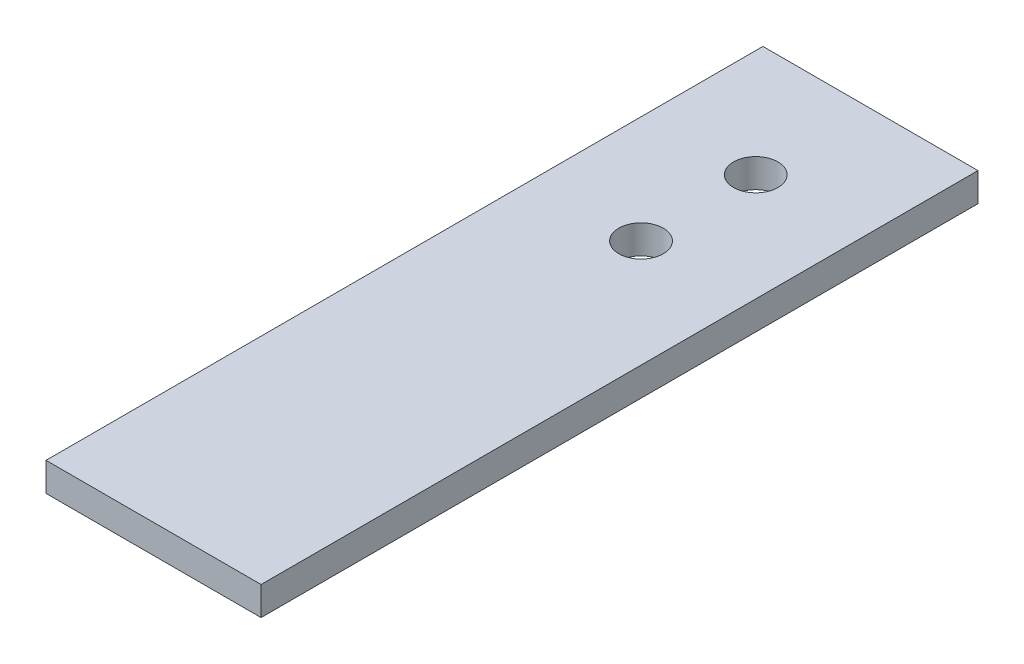
ISO-10303-21;
HEADER;
FILE_DESCRIPTION(('STEP AP214'),'2;1');
FILE_NAME('part.step','',(''),(''),'','','');
FILE_SCHEMA(('AUTOMOTIVE_DESIGN { 1 0 10303 214 1 1 1 1 }'));
ENDSEC;
DATA;
#1=APPLICATION_CONTEXT('core data for automotive mechanical design processes');
#2=APPLICATION_PROTOCOL_DEFINITION('international standard','automotive_design',2000,#1);
#3=PRODUCT_CONTEXT('',#1,'mechanical');
#4=PRODUCT('Part','Part','',(#3));
#5=PRODUCT_RELATED_PRODUCT_CATEGORY('part','',(#4));
#6=PRODUCT_DEFINITION_FORMATION('','',#4);
#7=PRODUCT_DEFINITION_CONTEXT('part definition',#1,'design');
#8=PRODUCT_DEFINITION('design','',#6,#7);
#9=PRODUCT_DEFINITION_SHAPE('','',#8);
#10=(LENGTH_UNIT() NAMED_UNIT(*) SI_UNIT(.MILLI.,.METRE.));
#11=(NAMED_UNIT(*) PLANE_ANGLE_UNIT() SI_UNIT($,.RADIAN.));
#12=(NAMED_UNIT(*) SI_UNIT($,.STERADIAN.) SOLID_ANGLE_UNIT());
#13=UNCERTAINTY_MEASURE_WITH_UNIT(LENGTH_MEASURE(1.E-05),#10,'distance_accuracy_value','');
#14=(GEOMETRIC_REPRESENTATION_CONTEXT(3) GLOBAL_UNCERTAINTY_ASSIGNED_CONTEXT((#13)) GLOBAL_UNIT_ASSIGNED_CONTEXT((#10,
#11,#12)) REPRESENTATION_CONTEXT('',''));
#15=CARTESIAN_POINT('',(0.,0.,0.));
#16=DIRECTION('',(0.,0.,1.));
#17=DIRECTION('',(1.,0.,0.));
#18=AXIS2_PLACEMENT_3D('',#15,#16,#17);
#19=CARTESIAN_POINT('',(0.,2.,0.));
#20=DIRECTION('',(0.,0.,1.));
#21=DIRECTION('',(1.,0.,0.));
#22=AXIS2_PLACEMENT_3D('',#19,#20,#21);
#23=PLANE('',#22);
#24=DIRECTION('',(-1.,0.,0.));
#25=VECTOR('',#24,1.);
#26=CARTESIAN_POINT('',(0.,0.,0.));
#27=LINE('',#26,#25);
#28=CARTESIAN_POINT('',(15.,0.,0.));
#29=VERTEX_POINT('',#28);
#30=CARTESIAN_POINT('',(0.,0.,0.));
#31=VERTEX_POINT('',#30);
#32=EDGE_CURVE('E105',#29,#31,#27,.T.);
#33=ORIENTED_EDGE('',*,*,#32,.F.);
#34=DIRECTION('',(0.,-1.,0.));
#35=VECTOR('',#34,1.);
#36=CARTESIAN_POINT('',(15.,2.,0.));
#37=LINE('',#36,#35);
#38=CARTESIAN_POINT('',(15.,2.,0.));
#39=VERTEX_POINT('',#38);
#40=EDGE_CURVE('E11',#39,#29,#37,.T.);
#41=ORIENTED_EDGE('',*,*,#40,.F.);
#42=DIRECTION('',(-1.,0.,0.));
#43=VECTOR('',#42,1.);
#44=CARTESIAN_POINT('',(0.,2.,0.));
#45=LINE('',#44,#43);
#46=CARTESIAN_POINT('',(0.,2.,0.));
#47=VERTEX_POINT('',#46);
#48=EDGE_CURVE('E91',#39,#47,#45,.T.);
#49=ORIENTED_EDGE('',*,*,#48,.T.);
#50=DIRECTION('',(0.,-1.,0.));
#51=VECTOR('',#50,1.);
#52=CARTESIAN_POINT('',(0.,2.,0.));
#53=LINE('',#52,#51);
#54=EDGE_CURVE('E52',#47,#31,#53,.T.);
#55=ORIENTED_EDGE('',*,*,#54,.T.);
#56=EDGE_LOOP('',(#33,#41,#49,#55));
#57=FACE_BOUND('',#56,.T.);
#58=ADVANCED_FACE('F35',(#57),#23,.T.);
#59=CARTESIAN_POINT('',(15.,2.,0.));
#60=DIRECTION('',(1.,0.,0.));
#61=DIRECTION('',(0.,0.,-1.));
#62=AXIS2_PLACEMENT_3D('',#59,#60,#61);
#63=PLANE('',#62);
#64=DIRECTION('',(0.,0.,1.));
#65=VECTOR('',#64,1.);
#66=CARTESIAN_POINT('',(15.,0.,0.));
#67=LINE('',#66,#65);
#68=CARTESIAN_POINT('',(15.,0.,-50.));
#69=VERTEX_POINT('',#68);
#70=EDGE_CURVE('E82',#69,#29,#67,.T.);
#71=ORIENTED_EDGE('',*,*,#70,.F.);
#72=DIRECTION('',(0.,-1.,0.));
#73=VECTOR('',#72,1.);
#74=CARTESIAN_POINT('',(15.,2.,-50.));
#75=LINE('',#74,#73);
#76=CARTESIAN_POINT('',(15.,2.,-50.));
#77=VERTEX_POINT('',#76);
#78=EDGE_CURVE('E44',#77,#69,#75,.T.);
#79=ORIENTED_EDGE('',*,*,#78,.F.);
#80=DIRECTION('',(0.,0.,1.));
#81=VECTOR('',#80,1.);
#82=CARTESIAN_POINT('',(15.,2.,0.));
#83=LINE('',#82,#81);
#84=EDGE_CURVE('E80',#77,#39,#83,.T.);
#85=ORIENTED_EDGE('',*,*,#84,.T.);
#86=ORIENTED_EDGE('',*,*,#40,.T.);
#87=EDGE_LOOP('',(#71,#79,#85,#86));
#88=FACE_BOUND('',#87,.T.);
#89=ADVANCED_FACE('F79',(#88),#63,.T.);
#90=CARTESIAN_POINT('',(0.,2.,-50.));
#91=DIRECTION('',(0.,0.,-1.));
#92=DIRECTION('',(-1.,0.,0.));
#93=AXIS2_PLACEMENT_3D('',#90,#91,#92);
#94=PLANE('',#93);
#95=DIRECTION('',(1.,0.,0.));
#96=VECTOR('',#95,1.);
#97=CARTESIAN_POINT('',(0.,0.,-50.));
#98=LINE('',#97,#96);
#99=CARTESIAN_POINT('',(0.,0.,-50.));
#100=VERTEX_POINT('',#99);
#101=EDGE_CURVE('E108',#100,#69,#98,.T.);
#102=ORIENTED_EDGE('',*,*,#101,.F.);
#103=DIRECTION('',(0.,-1.,0.));
#104=VECTOR('',#103,1.);
#105=CARTESIAN_POINT('',(0.,2.,-50.));
#106=LINE('',#105,#104);
#107=CARTESIAN_POINT('',(0.,2.,-50.));
#108=VERTEX_POINT('',#107);
#109=EDGE_CURVE('E65',#108,#100,#106,.T.);
#110=ORIENTED_EDGE('',*,*,#109,.F.);
#111=DIRECTION('',(1.,0.,0.));
#112=VECTOR('',#111,1.);
#113=CARTESIAN_POINT('',(0.,2.,-50.));
#114=LINE('',#113,#112);
#115=EDGE_CURVE('E90',#108,#77,#114,.T.);
#116=ORIENTED_EDGE('',*,*,#115,.T.);
#117=ORIENTED_EDGE('',*,*,#78,.T.);
#118=EDGE_LOOP('',(#102,#110,#116,#117));
#119=FACE_BOUND('',#118,.T.);
#120=ADVANCED_FACE('F93',(#119),#94,.T.);
#121=CARTESIAN_POINT('',(7.5,2.,-42.));
#122=DIRECTION('',(0.,-1.,0.));
#123=DIRECTION('',(0.,0.,-1.));
#124=AXIS2_PLACEMENT_3D('',#121,#122,#123);
#125=CYLINDRICAL_SURFACE('',#124,1.55);
#126=CARTESIAN_POINT('',(7.5,2.,-42.));
#127=DIRECTION('',(0.,1.,0.));
#128=DIRECTION('',(0.,0.,1.));
#129=AXIS2_PLACEMENT_3D('',#126,#127,#128);
#130=CIRCLE('',#129,1.55);
#131=CARTESIAN_POINT('',(7.5,2.,-40.45));
#132=VERTEX_POINT('',#131);
#133=EDGE_CURVE('E117',#132,#132,#130,.T.);
#134=ORIENTED_EDGE('',*,*,#133,.T.);
#135=EDGE_LOOP('',(#134));
#136=FACE_BOUND('',#135,.T.);
#137=CARTESIAN_POINT('',(7.5,0.,-42.));
#138=DIRECTION('',(0.,1.,0.));
#139=DIRECTION('',(0.,0.,1.));
#140=AXIS2_PLACEMENT_3D('',#137,#138,#139);
#141=CIRCLE('',#140,1.55);
#142=CARTESIAN_POINT('',(7.5,0.,-40.45));
#143=VERTEX_POINT('',#142);
#144=EDGE_CURVE('E102',#143,#143,#141,.T.);
#145=ORIENTED_EDGE('',*,*,#144,.F.);
#146=EDGE_LOOP('',(#145));
#147=FACE_BOUND('',#146,.T.);
#148=ADVANCED_FACE('F133',(#136,#147),#125,.F.);
#149=CARTESIAN_POINT('',(7.5,2.,-34.));
#150=DIRECTION('',(0.,-1.,0.));
#151=DIRECTION('',(0.,0.,-1.));
#152=AXIS2_PLACEMENT_3D('',#149,#150,#151);
#153=CYLINDRICAL_SURFACE('',#152,1.55);
#154=CARTESIAN_POINT('',(7.5,2.,-34.));
#155=DIRECTION('',(0.,1.,0.));
#156=DIRECTION('',(0.,0.,1.));
#157=AXIS2_PLACEMENT_3D('',#154,#155,#156);
#158=CIRCLE('',#157,1.55);
#159=CARTESIAN_POINT('',(7.5,2.,-32.45));
#160=VERTEX_POINT('',#159);
#161=EDGE_CURVE('E113',#160,#160,#158,.T.);
#162=ORIENTED_EDGE('',*,*,#161,.T.);
#163=EDGE_LOOP('',(#162));
#164=FACE_BOUND('',#163,.T.);
#165=CARTESIAN_POINT('',(7.5,0.,-34.));
#166=DIRECTION('',(0.,1.,0.));
#167=DIRECTION('',(0.,0.,1.));
#168=AXIS2_PLACEMENT_3D('',#165,#166,#167);
#169=CIRCLE('',#168,1.55);
#170=CARTESIAN_POINT('',(7.5,0.,-32.45));
#171=VERTEX_POINT('',#170);
#172=EDGE_CURVE('E99',#171,#171,#169,.T.);
#173=ORIENTED_EDGE('',*,*,#172,.F.);
#174=EDGE_LOOP('',(#173));
#175=FACE_BOUND('',#174,.T.);
#176=ADVANCED_FACE('F37',(#164,#175),#153,.F.);
#177=CARTESIAN_POINT('',(0.,2.,0.));
#178=DIRECTION('',(-1.,0.,0.));
#179=DIRECTION('',(0.,0.,1.));
#180=AXIS2_PLACEMENT_3D('',#177,#178,#179);
#181=PLANE('',#180);
#182=DIRECTION('',(0.,0.,-1.));
#183=VECTOR('',#182,1.);
#184=CARTESIAN_POINT('',(0.,0.,0.));
#185=LINE('',#184,#183);
#186=EDGE_CURVE('E110',#31,#100,#185,.T.);
#187=ORIENTED_EDGE('',*,*,#186,.F.);
#188=ORIENTED_EDGE('',*,*,#54,.F.);
#189=DIRECTION('',(0.,0.,-1.));
#190=VECTOR('',#189,1.);
#191=CARTESIAN_POINT('',(0.,2.,0.));
#192=LINE('',#191,#190);
#193=EDGE_CURVE('E94',#47,#108,#192,.T.);
#194=ORIENTED_EDGE('',*,*,#193,.T.);
#195=ORIENTED_EDGE('',*,*,#109,.T.);
#196=EDGE_LOOP('',(#187,#188,#194,#195));
#197=FACE_BOUND('',#196,.T.);
#198=ADVANCED_FACE('F123',(#197),#181,.T.);
#199=CARTESIAN_POINT('',(0.,2.,0.));
#200=DIRECTION('',(0.,1.,0.));
#201=DIRECTION('',(0.,0.,1.));
#202=AXIS2_PLACEMENT_3D('',#199,#200,#201);
#203=PLANE('',#202);
#204=ORIENTED_EDGE('',*,*,#161,.F.);
#205=EDGE_LOOP('',(#204));
#206=FACE_BOUND('',#205,.T.);
#207=ORIENTED_EDGE('',*,*,#133,.F.);
#208=EDGE_LOOP('',(#207));
#209=FACE_BOUND('',#208,.T.);
#210=ORIENTED_EDGE('',*,*,#48,.F.);
#211=ORIENTED_EDGE('',*,*,#84,.F.);
#212=ORIENTED_EDGE('',*,*,#115,.F.);
#213=ORIENTED_EDGE('',*,*,#193,.F.);
#214=EDGE_LOOP('',(#210,#211,#212,#213));
#215=FACE_BOUND('',#214,.T.);
#216=ADVANCED_FACE('F88',(#206,#209,#215),#203,.T.);
#217=CARTESIAN_POINT('',(0.,0.,0.));
#218=DIRECTION('',(0.,1.,0.));
#219=DIRECTION('',(0.,0.,1.));
#220=AXIS2_PLACEMENT_3D('',#217,#218,#219);
#221=PLANE('',#220);
#222=ORIENTED_EDGE('',*,*,#172,.T.);
#223=EDGE_LOOP('',(#222));
#224=FACE_BOUND('',#223,.T.);
#225=ORIENTED_EDGE('',*,*,#144,.T.);
#226=EDGE_LOOP('',(#225));
#227=FACE_BOUND('',#226,.T.);
#228=ORIENTED_EDGE('',*,*,#32,.T.);
#229=ORIENTED_EDGE('',*,*,#186,.T.);
#230=ORIENTED_EDGE('',*,*,#101,.T.);
#231=ORIENTED_EDGE('',*,*,#70,.T.);
#232=EDGE_LOOP('',(#228,#229,#230,#231));
#233=FACE_BOUND('',#232,.T.);
#234=ADVANCED_FACE('F130',(#224,#227,#233),#221,.F.);
#235=CLOSED_SHELL('',(#58,#89,#120,#148,#176,#198,#216,#234));
#236=MANIFOLD_SOLID_BREP('B2',#235);
#237=ADVANCED_BREP_SHAPE_REPRESENTATION('',(#18,#236),#14);
#238=SHAPE_DEFINITION_REPRESENTATION(#9,#237);
ENDSEC;
END-ISO-10303-21;
